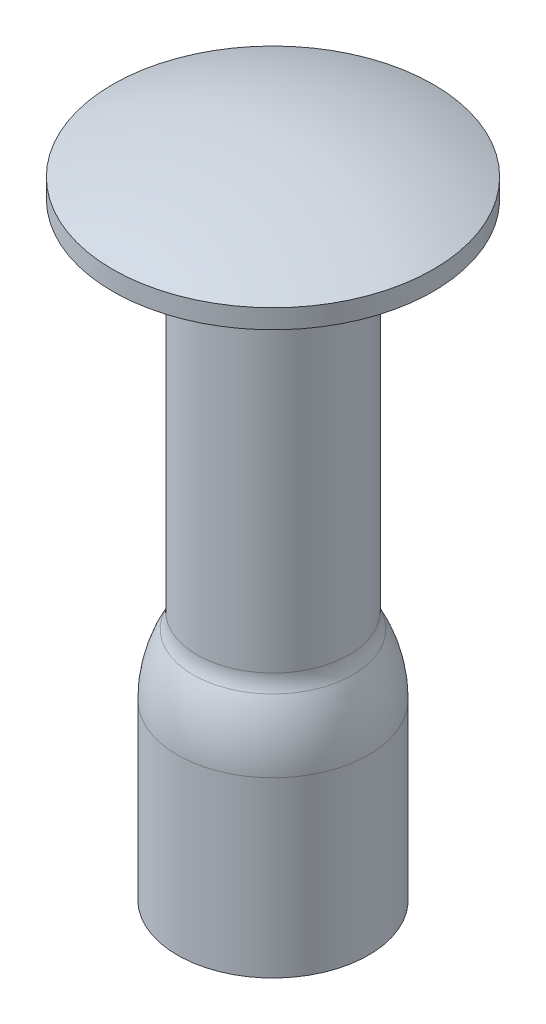
ISO-10303-21;
HEADER;
FILE_DESCRIPTION(('STEP AP214'),'2;1');
FILE_NAME('part.step','',(''),(''),'','','');
FILE_SCHEMA(('AUTOMOTIVE_DESIGN { 1 0 10303 214 1 1 1 1 }'));
ENDSEC;
DATA;
#1=APPLICATION_CONTEXT('core data for automotive mechanical design processes');
#2=APPLICATION_PROTOCOL_DEFINITION('international standard','automotive_design',2000,#1);
#3=PRODUCT_CONTEXT('',#1,'mechanical');
#4=PRODUCT('Part','Part','',(#3));
#5=PRODUCT_RELATED_PRODUCT_CATEGORY('part','',(#4));
#6=PRODUCT_DEFINITION_FORMATION('','',#4);
#7=PRODUCT_DEFINITION_CONTEXT('part definition',#1,'design');
#8=PRODUCT_DEFINITION('design','',#6,#7);
#9=PRODUCT_DEFINITION_SHAPE('','',#8);
#10=(LENGTH_UNIT() NAMED_UNIT(*) SI_UNIT(.MILLI.,.METRE.));
#11=(NAMED_UNIT(*) PLANE_ANGLE_UNIT() SI_UNIT($,.RADIAN.));
#12=(NAMED_UNIT(*) SI_UNIT($,.STERADIAN.) SOLID_ANGLE_UNIT());
#13=UNCERTAINTY_MEASURE_WITH_UNIT(LENGTH_MEASURE(1.E-05),#10,'distance_accuracy_value','');
#14=(GEOMETRIC_REPRESENTATION_CONTEXT(3) GLOBAL_UNCERTAINTY_ASSIGNED_CONTEXT((#13)) GLOBAL_UNIT_ASSIGNED_CONTEXT((#10,
#11,#12)) REPRESENTATION_CONTEXT('',''));
#15=CARTESIAN_POINT('',(0.,0.,0.));
#16=DIRECTION('',(0.,0.,1.));
#17=DIRECTION('',(1.,0.,0.));
#18=AXIS2_PLACEMENT_3D('',#15,#16,#17);
#19=CARTESIAN_POINT('',(0.,-5.60897944617785,0.));
#20=DIRECTION('',(0.,1.,0.));
#21=DIRECTION('',(1.,0.,0.));
#22=AXIS2_PLACEMENT_3D('',#19,#20,#21);
#23=SPHERICAL_SURFACE('',#22,6.42177944617785);
#24=CARTESIAN_POINT('',(0.,0.3,0.));
#25=DIRECTION('',(0.,1.,0.));
#26=DIRECTION('',(-1.,0.,0.));
#27=AXIS2_PLACEMENT_3D('',#24,#25,#26);
#28=CIRCLE('',#27,2.5146);
#29=CARTESIAN_POINT('',(-2.5146,0.3,0.));
#30=VERTEX_POINT('',#29);
#31=EDGE_CURVE('E10',#30,#30,#28,.T.);
#32=ORIENTED_EDGE('',*,*,#31,.T.);
#33=EDGE_LOOP('',(#32));
#34=FACE_BOUND('',#33,.T.);
#35=ADVANCED_FACE('F31',(#34),#23,.T.);
#36=CARTESIAN_POINT('',(0.,0.8128,0.));
#37=DIRECTION('',(0.,1.,0.));
#38=DIRECTION('',(-1.,0.,0.));
#39=AXIS2_PLACEMENT_3D('',#36,#37,#38);
#40=CYLINDRICAL_SURFACE('',#39,2.5146);
#41=ORIENTED_EDGE('',*,*,#31,.F.);
#42=EDGE_LOOP('',(#41));
#43=FACE_BOUND('',#42,.T.);
#44=CARTESIAN_POINT('',(0.,0.,0.));
#45=DIRECTION('',(0.,1.,0.));
#46=DIRECTION('',(-1.,0.,0.));
#47=AXIS2_PLACEMENT_3D('',#44,#45,#46);
#48=CIRCLE('',#47,2.5146);
#49=CARTESIAN_POINT('',(-2.5146,0.,0.));
#50=VERTEX_POINT('',#49);
#51=EDGE_CURVE('E37',#50,#50,#48,.T.);
#52=ORIENTED_EDGE('',*,*,#51,.T.);
#53=EDGE_LOOP('',(#52));
#54=FACE_BOUND('',#53,.T.);
#55=ADVANCED_FACE('F87',(#43,#54),#40,.T.);
#56=CARTESIAN_POINT('',(2.5146,0.,0.));
#57=DIRECTION('',(0.,1.,0.));
#58=DIRECTION('',(-1.,0.,0.));
#59=AXIS2_PLACEMENT_3D('',#56,#57,#58);
#60=PLANE('',#59);
#61=ORIENTED_EDGE('',*,*,#51,.F.);
#62=EDGE_LOOP('',(#61));
#63=FACE_BOUND('',#62,.T.);
#64=CARTESIAN_POINT('',(0.,0.,0.));
#65=DIRECTION('',(0.,1.,0.));
#66=DIRECTION('',(-1.,0.,0.));
#67=AXIS2_PLACEMENT_3D('',#64,#65,#66);
#68=CIRCLE('',#67,1.190625);
#69=CARTESIAN_POINT('',(-1.190625,0.,0.));
#70=VERTEX_POINT('',#69);
#71=EDGE_CURVE('E41',#70,#70,#68,.T.);
#72=ORIENTED_EDGE('',*,*,#71,.T.);
#73=EDGE_LOOP('',(#72));
#74=FACE_BOUND('',#73,.T.);
#75=ADVANCED_FACE('F91',(#63,#74),#60,.F.);
#76=CARTESIAN_POINT('',(0.,0.8128,0.));
#77=DIRECTION('',(0.,1.,0.));
#78=DIRECTION('',(-1.,0.,0.));
#79=AXIS2_PLACEMENT_3D('',#76,#77,#78);
#80=CYLINDRICAL_SURFACE('',#79,1.190625);
#81=ORIENTED_EDGE('',*,*,#71,.F.);
#82=EDGE_LOOP('',(#81));
#83=FACE_BOUND('',#82,.T.);
#84=CARTESIAN_POINT('',(0.,-5.6,0.));
#85=DIRECTION('',(0.,1.,0.));
#86=DIRECTION('',(-1.,0.,0.));
#87=AXIS2_PLACEMENT_3D('',#84,#85,#86);
#88=CIRCLE('',#87,1.190625);
#89=CARTESIAN_POINT('',(-1.190625,-5.6,0.));
#90=VERTEX_POINT('',#89);
#91=EDGE_CURVE('E45',#90,#90,#88,.T.);
#92=ORIENTED_EDGE('',*,*,#91,.T.);
#93=EDGE_LOOP('',(#92));
#94=FACE_BOUND('',#93,.T.);
#95=ADVANCED_FACE('F96',(#83,#94),#80,.T.);
#96=CARTESIAN_POINT('',(0.,-5.6,0.));
#97=DIRECTION('',(0.,1.,0.));
#98=DIRECTION('',(-1.,0.,0.));
#99=AXIS2_PLACEMENT_3D('',#96,#97,#98);
#100=TOROIDAL_SURFACE('',#99,1.690625,0.5);
#101=ORIENTED_EDGE('',*,*,#91,.F.);
#102=EDGE_LOOP('',(#101));
#103=FACE_BOUND('',#102,.T.);
#104=CARTESIAN_POINT('',(0.,-5.8409283801776,0.));
#105=DIRECTION('',(0.,1.,0.));
#106=DIRECTION('',(-1.,0.,0.));
#107=AXIS2_PLACEMENT_3D('',#104,#105,#106);
#108=CIRCLE('',#107,1.2525);
#109=CARTESIAN_POINT('',(-1.2525,-5.8409283801776,0.));
#110=VERTEX_POINT('',#109);
#111=EDGE_CURVE('E50',#110,#110,#108,.T.);
#112=ORIENTED_EDGE('',*,*,#111,.T.);
#113=EDGE_LOOP('',(#112));
#114=FACE_BOUND('',#113,.T.);
#115=ADVANCED_FACE('F102',(#103,#114),#100,.F.);
#116=CARTESIAN_POINT('',(0.,-6.80464190088798,0.));
#117=DIRECTION('',(0.,1.,0.));
#118=DIRECTION('',(-1.,0.,0.));
#119=AXIS2_PLACEMENT_3D('',#116,#117,#118);
#120=DEGENERATE_TOROIDAL_SURFACE('',#119,0.5,2.,.F.);
#121=ORIENTED_EDGE('',*,*,#111,.F.);
#122=EDGE_LOOP('',(#121));
#123=FACE_BOUND('',#122,.T.);
#124=CARTESIAN_POINT('',(0.,-6.80464190088798,0.));
#125=DIRECTION('',(0.,1.,0.));
#126=DIRECTION('',(-1.,0.,0.));
#127=AXIS2_PLACEMENT_3D('',#124,#125,#126);
#128=CIRCLE('',#127,1.5);
#129=CARTESIAN_POINT('',(-1.5,-6.80464190088798,0.));
#130=VERTEX_POINT('',#129);
#131=EDGE_CURVE('E53',#130,#130,#128,.T.);
#132=ORIENTED_EDGE('',*,*,#131,.T.);
#133=EDGE_LOOP('',(#132));
#134=FACE_BOUND('',#133,.T.);
#135=ADVANCED_FACE('F106',(#123,#134),#120,.F.);
#136=CARTESIAN_POINT('',(0.,0.8128,0.));
#137=DIRECTION('',(0.,1.,0.));
#138=DIRECTION('',(-1.,0.,0.));
#139=AXIS2_PLACEMENT_3D('',#136,#137,#138);
#140=CYLINDRICAL_SURFACE('',#139,1.5);
#141=ORIENTED_EDGE('',*,*,#131,.F.);
#142=EDGE_LOOP('',(#141));
#143=FACE_BOUND('',#142,.T.);
#144=CARTESIAN_POINT('',(0.,-9.525,0.));
#145=DIRECTION('',(0.,1.,0.));
#146=DIRECTION('',(-1.,0.,0.));
#147=AXIS2_PLACEMENT_3D('',#144,#145,#146);
#148=CIRCLE('',#147,1.5);
#149=CARTESIAN_POINT('',(-1.5,-9.525,0.));
#150=VERTEX_POINT('',#149);
#151=EDGE_CURVE('E56',#150,#150,#148,.T.);
#152=ORIENTED_EDGE('',*,*,#151,.T.);
#153=EDGE_LOOP('',(#152));
#154=FACE_BOUND('',#153,.T.);
#155=ADVANCED_FACE('F110',(#143,#154),#140,.T.);
#156=CARTESIAN_POINT('',(1.3,-9.525,0.));
#157=DIRECTION('',(0.,1.,0.));
#158=DIRECTION('',(-1.,0.,0.));
#159=AXIS2_PLACEMENT_3D('',#156,#157,#158);
#160=PLANE('',#159);
#161=ORIENTED_EDGE('',*,*,#151,.F.);
#162=EDGE_LOOP('',(#161));
#163=FACE_BOUND('',#162,.T.);
#164=CARTESIAN_POINT('',(0.,-9.525,0.));
#165=DIRECTION('',(0.,1.,0.));
#166=DIRECTION('',(-1.,0.,0.));
#167=AXIS2_PLACEMENT_3D('',#164,#165,#166);
#168=CIRCLE('',#167,1.3);
#169=CARTESIAN_POINT('',(-1.3,-9.525,0.));
#170=VERTEX_POINT('',#169);
#171=EDGE_CURVE('E59',#170,#170,#168,.T.);
#172=ORIENTED_EDGE('',*,*,#171,.T.);
#173=EDGE_LOOP('',(#172));
#174=FACE_BOUND('',#173,.T.);
#175=ADVANCED_FACE('F114',(#163,#174),#160,.F.);
#176=CARTESIAN_POINT('',(0.,0.8128,0.));
#177=DIRECTION('',(0.,1.,0.));
#178=DIRECTION('',(-1.,0.,0.));
#179=AXIS2_PLACEMENT_3D('',#176,#177,#178);
#180=CYLINDRICAL_SURFACE('',#179,1.3);
#181=ORIENTED_EDGE('',*,*,#171,.F.);
#182=EDGE_LOOP('',(#181));
#183=FACE_BOUND('',#182,.T.);
#184=CARTESIAN_POINT('',(0.,-6.80464190088798,0.));
#185=DIRECTION('',(0.,1.,0.));
#186=DIRECTION('',(-1.,0.,0.));
#187=AXIS2_PLACEMENT_3D('',#184,#185,#186);
#188=CIRCLE('',#187,1.3);
#189=CARTESIAN_POINT('',(-1.3,-6.80464190088798,0.));
#190=VERTEX_POINT('',#189);
#191=EDGE_CURVE('E62',#190,#190,#188,.T.);
#192=ORIENTED_EDGE('',*,*,#191,.T.);
#193=EDGE_LOOP('',(#192));
#194=FACE_BOUND('',#193,.T.);
#195=ADVANCED_FACE('F118',(#183,#194),#180,.F.);
#196=CARTESIAN_POINT('',(0.,-6.80464190088798,0.));
#197=DIRECTION('',(0.,1.,0.));
#198=DIRECTION('',(-1.,0.,0.));
#199=AXIS2_PLACEMENT_3D('',#196,#197,#198);
#200=DEGENERATE_TOROIDAL_SURFACE('',#199,0.5,1.8,.F.);
#201=ORIENTED_EDGE('',*,*,#191,.F.);
#202=EDGE_LOOP('',(#201));
#203=FACE_BOUND('',#202,.T.);
#204=CARTESIAN_POINT('',(0.,-5.93729973224864,0.));
#205=DIRECTION('',(0.,1.,0.));
#206=DIRECTION('',(-1.,0.,0.));
#207=AXIS2_PLACEMENT_3D('',#204,#205,#206);
#208=CIRCLE('',#207,1.07725);
#209=CARTESIAN_POINT('',(-1.07725,-5.93729973224864,0.));
#210=VERTEX_POINT('',#209);
#211=EDGE_CURVE('E65',#210,#210,#208,.T.);
#212=ORIENTED_EDGE('',*,*,#211,.T.);
#213=EDGE_LOOP('',(#212));
#214=FACE_BOUND('',#213,.T.);
#215=ADVANCED_FACE('F122',(#203,#214),#200,.T.);
#216=CARTESIAN_POINT('',(0.,-5.6,0.));
#217=DIRECTION('',(0.,1.,0.));
#218=DIRECTION('',(-1.,0.,0.));
#219=AXIS2_PLACEMENT_3D('',#216,#217,#218);
#220=TOROIDAL_SURFACE('',#219,1.690625,0.7);
#221=ORIENTED_EDGE('',*,*,#211,.F.);
#222=EDGE_LOOP('',(#221));
#223=FACE_BOUND('',#222,.T.);
#224=CARTESIAN_POINT('',(0.,-5.6,0.));
#225=DIRECTION('',(0.,1.,0.));
#226=DIRECTION('',(-1.,0.,0.));
#227=AXIS2_PLACEMENT_3D('',#224,#225,#226);
#228=CIRCLE('',#227,0.990624999999999);
#229=CARTESIAN_POINT('',(-0.990624999999998,-5.6,0.));
#230=VERTEX_POINT('',#229);
#231=EDGE_CURVE('E68',#230,#230,#228,.T.);
#232=ORIENTED_EDGE('',*,*,#231,.T.);
#233=EDGE_LOOP('',(#232));
#234=FACE_BOUND('',#233,.T.);
#235=ADVANCED_FACE('F83',(#223,#234),#220,.T.);
#236=CARTESIAN_POINT('',(0.,0.8128,0.));
#237=DIRECTION('',(0.,1.,0.));
#238=DIRECTION('',(-1.,0.,0.));
#239=AXIS2_PLACEMENT_3D('',#236,#237,#238);
#240=CYLINDRICAL_SURFACE('',#239,0.990624999999999);
#241=ORIENTED_EDGE('',*,*,#231,.F.);
#242=EDGE_LOOP('',(#241));
#243=FACE_BOUND('',#242,.T.);
#244=CARTESIAN_POINT('',(0.,0.,0.));
#245=DIRECTION('',(0.,1.,0.));
#246=DIRECTION('',(-1.,0.,0.));
#247=AXIS2_PLACEMENT_3D('',#244,#245,#246);
#248=CIRCLE('',#247,0.990625);
#249=CARTESIAN_POINT('',(-0.990625,0.,0.));
#250=VERTEX_POINT('',#249);
#251=EDGE_CURVE('E71',#250,#250,#248,.T.);
#252=ORIENTED_EDGE('',*,*,#251,.T.);
#253=EDGE_LOOP('',(#252));
#254=FACE_BOUND('',#253,.T.);
#255=ADVANCED_FACE('F75',(#243,#254),#240,.F.);
#256=CARTESIAN_POINT('',(0.990625,0.,0.));
#257=DIRECTION('',(0.,1.,0.));
#258=DIRECTION('',(-1.,0.,0.));
#259=AXIS2_PLACEMENT_3D('',#256,#257,#258);
#260=PLANE('',#259);
#261=ORIENTED_EDGE('',*,*,#251,.F.);
#262=EDGE_LOOP('',(#261));
#263=FACE_BOUND('',#262,.T.);
#264=ADVANCED_FACE('F77',(#263),#260,.F.);
#265=CLOSED_SHELL('',(#35,#55,#75,#95,#115,#135,#155,#175,#195,#215,#235,#255,#264));
#266=MANIFOLD_SOLID_BREP('B2',#265);
#267=ADVANCED_BREP_SHAPE_REPRESENTATION('',(#18,#266),#14);
#268=SHAPE_DEFINITION_REPRESENTATION(#9,#267);
ENDSEC;
END-ISO-10303-21;
